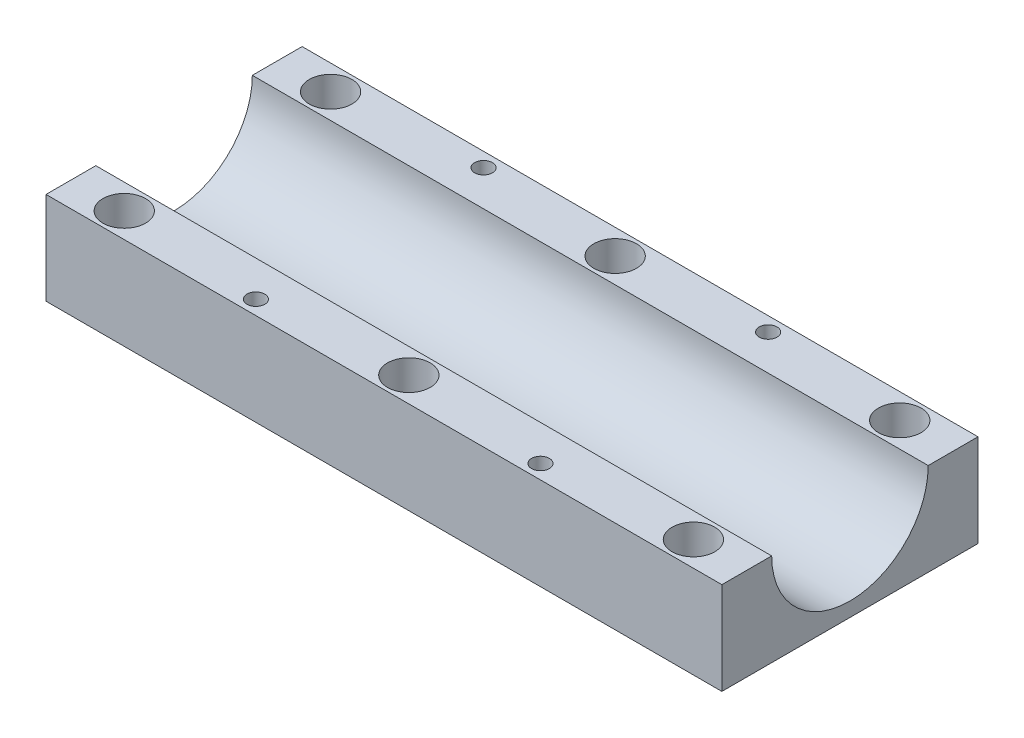
ISO-10303-21;
HEADER;
FILE_DESCRIPTION(('STEP AP214'),'2;1');
FILE_NAME('part.step','',(''),(''),'','','');
FILE_SCHEMA(('AUTOMOTIVE_DESIGN { 1 0 10303 214 1 1 1 1 }'));
ENDSEC;
DATA;
#1=APPLICATION_CONTEXT('core data for automotive mechanical design processes');
#2=APPLICATION_PROTOCOL_DEFINITION('international standard','automotive_design',2000,#1);
#3=PRODUCT_CONTEXT('',#1,'mechanical');
#4=PRODUCT('Part','Part','',(#3));
#5=PRODUCT_RELATED_PRODUCT_CATEGORY('part','',(#4));
#6=PRODUCT_DEFINITION_FORMATION('','',#4);
#7=PRODUCT_DEFINITION_CONTEXT('part definition',#1,'design');
#8=PRODUCT_DEFINITION('design','',#6,#7);
#9=PRODUCT_DEFINITION_SHAPE('','',#8);
#10=(LENGTH_UNIT() NAMED_UNIT(*) SI_UNIT(.MILLI.,.METRE.));
#11=(NAMED_UNIT(*) PLANE_ANGLE_UNIT() SI_UNIT($,.RADIAN.));
#12=(NAMED_UNIT(*) SI_UNIT($,.STERADIAN.) SOLID_ANGLE_UNIT());
#13=UNCERTAINTY_MEASURE_WITH_UNIT(LENGTH_MEASURE(1.E-05),#10,'distance_accuracy_value','');
#14=(GEOMETRIC_REPRESENTATION_CONTEXT(3) GLOBAL_UNCERTAINTY_ASSIGNED_CONTEXT((#13)) GLOBAL_UNIT_ASSIGNED_CONTEXT((#10,
#11,#12)) REPRESENTATION_CONTEXT('',''));
#15=CARTESIAN_POINT('',(0.,0.,0.));
#16=DIRECTION('',(0.,0.,1.));
#17=DIRECTION('',(1.,0.,0.));
#18=AXIS2_PLACEMENT_3D('',#15,#16,#17);
#19=CARTESIAN_POINT('',(7.5,13.,-32.5));
#20=DIRECTION('',(0.,-1.,0.));
#21=DIRECTION('',(0.,0.,-1.));
#22=AXIS2_PLACEMENT_3D('',#19,#20,#21);
#23=CYLINDRICAL_SURFACE('',#22,1.75);
#24=CARTESIAN_POINT('',(7.5,0.,-32.5));
#25=DIRECTION('',(0.,1.,0.));
#26=DIRECTION('',(0.,0.,1.));
#27=AXIS2_PLACEMENT_3D('',#24,#25,#26);
#28=CIRCLE('',#27,1.75);
#29=CARTESIAN_POINT('',(7.5,0.,-30.75));
#30=VERTEX_POINT('',#29);
#31=EDGE_CURVE('E114',#30,#30,#28,.T.);
#32=ORIENTED_EDGE('',*,*,#31,.F.);
#33=EDGE_LOOP('',(#32));
#34=FACE_BOUND('',#33,.T.);
#35=CARTESIAN_POINT('',(7.5,8.,-32.5));
#36=DIRECTION('',(0.,1.,0.));
#37=DIRECTION('',(0.,0.,1.));
#38=AXIS2_PLACEMENT_3D('',#35,#36,#37);
#39=CIRCLE('',#38,1.75);
#40=CARTESIAN_POINT('',(7.5,8.,-30.75));
#41=VERTEX_POINT('',#40);
#42=EDGE_CURVE('E38',#41,#41,#39,.T.);
#43=ORIENTED_EDGE('',*,*,#42,.T.);
#44=EDGE_LOOP('',(#43));
#45=FACE_BOUND('',#44,.T.);
#46=ADVANCED_FACE('F34',(#34,#45),#23,.F.);
#47=CARTESIAN_POINT('',(47.5,13.,-32.5));
#48=DIRECTION('',(0.,-1.,0.));
#49=DIRECTION('',(0.,0.,-1.));
#50=AXIS2_PLACEMENT_3D('',#47,#48,#49);
#51=CYLINDRICAL_SURFACE('',#50,1.75);
#52=CARTESIAN_POINT('',(47.5,0.,-32.5));
#53=DIRECTION('',(0.,1.,0.));
#54=DIRECTION('',(0.,0.,1.));
#55=AXIS2_PLACEMENT_3D('',#52,#53,#54);
#56=CIRCLE('',#55,1.75);
#57=CARTESIAN_POINT('',(47.5,0.,-30.75));
#58=VERTEX_POINT('',#57);
#59=EDGE_CURVE('E187',#58,#58,#56,.T.);
#60=ORIENTED_EDGE('',*,*,#59,.F.);
#61=EDGE_LOOP('',(#60));
#62=FACE_BOUND('',#61,.T.);
#63=CARTESIAN_POINT('',(47.5,8.,-32.5));
#64=DIRECTION('',(0.,1.,0.));
#65=DIRECTION('',(0.,0.,1.));
#66=AXIS2_PLACEMENT_3D('',#63,#64,#65);
#67=CIRCLE('',#66,1.75);
#68=CARTESIAN_POINT('',(47.5,8.,-30.75));
#69=VERTEX_POINT('',#68);
#70=EDGE_CURVE('E150',#69,#69,#67,.T.);
#71=ORIENTED_EDGE('',*,*,#70,.T.);
#72=EDGE_LOOP('',(#71));
#73=FACE_BOUND('',#72,.T.);
#74=ADVANCED_FACE('F198',(#62,#73),#51,.F.);
#75=CARTESIAN_POINT('',(87.5,13.,-32.5));
#76=DIRECTION('',(0.,-1.,0.));
#77=DIRECTION('',(0.,0.,-1.));
#78=AXIS2_PLACEMENT_3D('',#75,#76,#77);
#79=CYLINDRICAL_SURFACE('',#78,1.75000000000001);
#80=CARTESIAN_POINT('',(87.5,0.,-32.5));
#81=DIRECTION('',(0.,1.,0.));
#82=DIRECTION('',(0.,0.,1.));
#83=AXIS2_PLACEMENT_3D('',#80,#81,#82);
#84=CIRCLE('',#83,1.75000000000001);
#85=CARTESIAN_POINT('',(87.5,0.,-30.75));
#86=VERTEX_POINT('',#85);
#87=EDGE_CURVE('E185',#86,#86,#84,.T.);
#88=ORIENTED_EDGE('',*,*,#87,.F.);
#89=EDGE_LOOP('',(#88));
#90=FACE_BOUND('',#89,.T.);
#91=CARTESIAN_POINT('',(87.5,8.,-32.5));
#92=DIRECTION('',(0.,1.,0.));
#93=DIRECTION('',(0.,0.,1.));
#94=AXIS2_PLACEMENT_3D('',#91,#92,#93);
#95=CIRCLE('',#94,1.75000000000001);
#96=CARTESIAN_POINT('',(87.5,8.,-30.75));
#97=VERTEX_POINT('',#96);
#98=EDGE_CURVE('E148',#97,#97,#95,.T.);
#99=ORIENTED_EDGE('',*,*,#98,.T.);
#100=EDGE_LOOP('',(#99));
#101=FACE_BOUND('',#100,.T.);
#102=ADVANCED_FACE('F203',(#90,#101),#79,.F.);
#103=CARTESIAN_POINT('',(0.,13.,0.));
#104=DIRECTION('',(0.,-1.,0.));
#105=DIRECTION('',(0.,0.,-1.));
#106=AXIS2_PLACEMENT_3D('',#103,#104,#105);
#107=PLANE('',#106);
#108=CARTESIAN_POINT('',(27.5,13.,-34.));
#109=DIRECTION('',(0.,1.,0.));
#110=DIRECTION('',(0.,0.,1.));
#111=AXIS2_PLACEMENT_3D('',#108,#109,#110);
#112=CIRCLE('',#111,1.25);
#113=CARTESIAN_POINT('',(27.5,13.,-32.75));
#114=VERTEX_POINT('',#113);
#115=EDGE_CURVE('E328',#114,#114,#112,.T.);
#116=ORIENTED_EDGE('',*,*,#115,.F.);
#117=EDGE_LOOP('',(#116));
#118=FACE_BOUND('',#117,.T.);
#119=CARTESIAN_POINT('',(47.5,13.,-32.5));
#120=DIRECTION('',(0.,1.,0.));
#121=DIRECTION('',(0.,0.,1.));
#122=AXIS2_PLACEMENT_3D('',#119,#120,#121);
#123=CIRCLE('',#122,3.);
#124=CARTESIAN_POINT('',(47.5,13.,-29.5));
#125=VERTEX_POINT('',#124);
#126=EDGE_CURVE('E276',#125,#125,#123,.T.);
#127=ORIENTED_EDGE('',*,*,#126,.F.);
#128=EDGE_LOOP('',(#127));
#129=FACE_BOUND('',#128,.T.);
#130=CARTESIAN_POINT('',(87.5,13.,-32.5));
#131=DIRECTION('',(0.,1.,0.));
#132=DIRECTION('',(0.,0.,1.));
#133=AXIS2_PLACEMENT_3D('',#130,#131,#132);
#134=CIRCLE('',#133,3.00000000000001);
#135=CARTESIAN_POINT('',(87.5,13.,-29.5));
#136=VERTEX_POINT('',#135);
#137=EDGE_CURVE('E277',#136,#136,#134,.T.);
#138=ORIENTED_EDGE('',*,*,#137,.F.);
#139=EDGE_LOOP('',(#138));
#140=FACE_BOUND('',#139,.T.);
#141=CARTESIAN_POINT('',(67.5,13.,-34.));
#142=DIRECTION('',(0.,1.,0.));
#143=DIRECTION('',(0.,0.,1.));
#144=AXIS2_PLACEMENT_3D('',#141,#142,#143);
#145=CIRCLE('',#144,1.25);
#146=CARTESIAN_POINT('',(67.5,13.,-32.75));
#147=VERTEX_POINT('',#146);
#148=EDGE_CURVE('E320',#147,#147,#145,.T.);
#149=ORIENTED_EDGE('',*,*,#148,.F.);
#150=EDGE_LOOP('',(#149));
#151=FACE_BOUND('',#150,.T.);
#152=CARTESIAN_POINT('',(7.5,13.,-32.5));
#153=DIRECTION('',(0.,1.,0.));
#154=DIRECTION('',(0.,0.,1.));
#155=AXIS2_PLACEMENT_3D('',#152,#153,#154);
#156=CIRCLE('',#155,3.);
#157=CARTESIAN_POINT('',(7.5,13.,-29.5));
#158=VERTEX_POINT('',#157);
#159=EDGE_CURVE('E167',#158,#158,#156,.T.);
#160=ORIENTED_EDGE('',*,*,#159,.F.);
#161=EDGE_LOOP('',(#160));
#162=FACE_BOUND('',#161,.T.);
#163=DIRECTION('',(0.,0.,1.));
#164=VECTOR('',#163,1.);
#165=CARTESIAN_POINT('',(0.,13.,0.));
#166=LINE('',#165,#164);
#167=CARTESIAN_POINT('',(0.,13.,-36.));
#168=VERTEX_POINT('',#167);
#169=CARTESIAN_POINT('',(0.,13.,-29.));
#170=VERTEX_POINT('',#169);
#171=EDGE_CURVE('E105',#168,#170,#166,.T.);
#172=ORIENTED_EDGE('',*,*,#171,.T.);
#173=DIRECTION('',(1.,0.,0.));
#174=VECTOR('',#173,1.);
#175=CARTESIAN_POINT('',(0.,13.,-29.));
#176=LINE('',#175,#174);
#177=CARTESIAN_POINT('',(95.,13.,-29.));
#178=VERTEX_POINT('',#177);
#179=EDGE_CURVE('E96',#170,#178,#176,.T.);
#180=ORIENTED_EDGE('',*,*,#179,.T.);
#181=DIRECTION('',(0.,0.,-1.));
#182=VECTOR('',#181,1.);
#183=CARTESIAN_POINT('',(95.,13.,0.));
#184=LINE('',#183,#182);
#185=CARTESIAN_POINT('',(95.,13.,-36.));
#186=VERTEX_POINT('',#185);
#187=EDGE_CURVE('E111',#178,#186,#184,.T.);
#188=ORIENTED_EDGE('',*,*,#187,.T.);
#189=DIRECTION('',(-1.,0.,0.));
#190=VECTOR('',#189,1.);
#191=CARTESIAN_POINT('',(0.,13.,-36.));
#192=LINE('',#191,#190);
#193=EDGE_CURVE('E59',#186,#168,#192,.T.);
#194=ORIENTED_EDGE('',*,*,#193,.T.);
#195=EDGE_LOOP('',(#172,#180,#188,#194));
#196=FACE_BOUND('',#195,.T.);
#197=ADVANCED_FACE('F108',(#118,#129,#140,#151,#162,#196),#107,.F.);
#198=CARTESIAN_POINT('',(7.5,13.,-3.5));
#199=DIRECTION('',(0.,1.,0.));
#200=DIRECTION('',(0.,0.,-1.));
#201=AXIS2_PLACEMENT_3D('',#198,#199,#200);
#202=CIRCLE('',#201,3.);
#203=CARTESIAN_POINT('',(7.5,13.,-6.5));
#204=VERTEX_POINT('',#203);
#205=EDGE_CURVE('E173',#204,#204,#202,.T.);
#206=ORIENTED_EDGE('',*,*,#205,.F.);
#207=EDGE_LOOP('',(#206));
#208=FACE_BOUND('',#207,.T.);
#209=CARTESIAN_POINT('',(67.5,13.,-1.99999999999999));
#210=DIRECTION('',(0.,1.,0.));
#211=DIRECTION('',(0.,0.,-1.));
#212=AXIS2_PLACEMENT_3D('',#209,#210,#211);
#213=CIRCLE('',#212,1.25);
#214=CARTESIAN_POINT('',(67.5,13.,-3.24999999999999));
#215=VERTEX_POINT('',#214);
#216=EDGE_CURVE('E289',#215,#215,#213,.T.);
#217=ORIENTED_EDGE('',*,*,#216,.F.);
#218=EDGE_LOOP('',(#217));
#219=FACE_BOUND('',#218,.T.);
#220=CARTESIAN_POINT('',(47.5,13.,-3.5));
#221=DIRECTION('',(0.,1.,0.));
#222=DIRECTION('',(0.,0.,-1.));
#223=AXIS2_PLACEMENT_3D('',#220,#221,#222);
#224=CIRCLE('',#223,3.);
#225=CARTESIAN_POINT('',(47.5,13.,-6.5));
#226=VERTEX_POINT('',#225);
#227=EDGE_CURVE('E294',#226,#226,#224,.T.);
#228=ORIENTED_EDGE('',*,*,#227,.F.);
#229=EDGE_LOOP('',(#228));
#230=FACE_BOUND('',#229,.T.);
#231=CARTESIAN_POINT('',(87.5,13.,-3.5));
#232=DIRECTION('',(0.,1.,0.));
#233=DIRECTION('',(0.,0.,-1.));
#234=AXIS2_PLACEMENT_3D('',#231,#232,#233);
#235=CIRCLE('',#234,3.00000000000001);
#236=CARTESIAN_POINT('',(87.5,13.,-6.5));
#237=VERTEX_POINT('',#236);
#238=EDGE_CURVE('E311',#237,#237,#235,.T.);
#239=ORIENTED_EDGE('',*,*,#238,.F.);
#240=EDGE_LOOP('',(#239));
#241=FACE_BOUND('',#240,.T.);
#242=CARTESIAN_POINT('',(27.5,13.,-1.99999999999999));
#243=DIRECTION('',(0.,1.,0.));
#244=DIRECTION('',(0.,0.,-1.));
#245=AXIS2_PLACEMENT_3D('',#242,#243,#244);
#246=CIRCLE('',#245,1.25);
#247=CARTESIAN_POINT('',(27.5,13.,-3.25));
#248=VERTEX_POINT('',#247);
#249=EDGE_CURVE('E314',#248,#248,#246,.T.);
#250=ORIENTED_EDGE('',*,*,#249,.F.);
#251=EDGE_LOOP('',(#250));
#252=FACE_BOUND('',#251,.T.);
#253=CARTESIAN_POINT('',(95.,13.,0.));
#254=VERTEX_POINT('',#253);
#255=CARTESIAN_POINT('',(95.,13.,-7.));
#256=VERTEX_POINT('',#255);
#257=EDGE_CURVE('E117',#254,#256,#184,.T.);
#258=ORIENTED_EDGE('',*,*,#257,.T.);
#259=DIRECTION('',(1.,0.,0.));
#260=VECTOR('',#259,1.);
#261=CARTESIAN_POINT('',(0.,13.,-7.));
#262=LINE('',#261,#260);
#263=CARTESIAN_POINT('',(0.,13.,-7.));
#264=VERTEX_POINT('',#263);
#265=EDGE_CURVE('E51',#256,#264,#262,.F.);
#266=ORIENTED_EDGE('',*,*,#265,.T.);
#267=CARTESIAN_POINT('',(0.,13.,0.));
#268=VERTEX_POINT('',#267);
#269=EDGE_CURVE('E87',#264,#268,#166,.T.);
#270=ORIENTED_EDGE('',*,*,#269,.T.);
#271=DIRECTION('',(1.,0.,0.));
#272=VECTOR('',#271,1.);
#273=CARTESIAN_POINT('',(0.,13.,0.));
#274=LINE('',#273,#272);
#275=EDGE_CURVE('E109',#268,#254,#274,.T.);
#276=ORIENTED_EDGE('',*,*,#275,.T.);
#277=EDGE_LOOP('',(#258,#266,#270,#276));
#278=FACE_BOUND('',#277,.T.);
#279=ADVANCED_FACE('F208',(#208,#219,#230,#241,#252,#278),#107,.F.);
#280=CARTESIAN_POINT('',(0.,0.,0.));
#281=DIRECTION('',(0.,-1.,0.));
#282=DIRECTION('',(0.,0.,-1.));
#283=AXIS2_PLACEMENT_3D('',#280,#281,#282);
#284=PLANE('',#283);
#285=CARTESIAN_POINT('',(47.5,0.,-3.5));
#286=DIRECTION('',(0.,1.,0.));
#287=DIRECTION('',(0.,0.,-1.));
#288=AXIS2_PLACEMENT_3D('',#285,#286,#287);
#289=CIRCLE('',#288,1.75);
#290=CARTESIAN_POINT('',(47.5,0.,-5.24999999999999));
#291=VERTEX_POINT('',#290);
#292=EDGE_CURVE('E179',#291,#291,#289,.T.);
#293=ORIENTED_EDGE('',*,*,#292,.T.);
#294=EDGE_LOOP('',(#293));
#295=FACE_BOUND('',#294,.T.);
#296=ORIENTED_EDGE('',*,*,#87,.T.);
#297=EDGE_LOOP('',(#296));
#298=FACE_BOUND('',#297,.T.);
#299=ORIENTED_EDGE('',*,*,#31,.T.);
#300=EDGE_LOOP('',(#299));
#301=FACE_BOUND('',#300,.T.);
#302=DIRECTION('',(0.,0.,1.));
#303=VECTOR('',#302,1.);
#304=CARTESIAN_POINT('',(0.,0.,0.));
#305=LINE('',#304,#303);
#306=CARTESIAN_POINT('',(0.,0.,-36.));
#307=VERTEX_POINT('',#306);
#308=CARTESIAN_POINT('',(0.,0.,0.));
#309=VERTEX_POINT('',#308);
#310=EDGE_CURVE('E122',#307,#309,#305,.T.);
#311=ORIENTED_EDGE('',*,*,#310,.F.);
#312=DIRECTION('',(-1.,0.,0.));
#313=VECTOR('',#312,1.);
#314=CARTESIAN_POINT('',(0.,0.,-36.));
#315=LINE('',#314,#313);
#316=CARTESIAN_POINT('',(95.,0.,-36.));
#317=VERTEX_POINT('',#316);
#318=EDGE_CURVE('E80',#317,#307,#315,.T.);
#319=ORIENTED_EDGE('',*,*,#318,.F.);
#320=DIRECTION('',(0.,0.,-1.));
#321=VECTOR('',#320,1.);
#322=CARTESIAN_POINT('',(95.,0.,0.));
#323=LINE('',#322,#321);
#324=CARTESIAN_POINT('',(95.,0.,0.));
#325=VERTEX_POINT('',#324);
#326=EDGE_CURVE('E127',#325,#317,#323,.T.);
#327=ORIENTED_EDGE('',*,*,#326,.F.);
#328=DIRECTION('',(1.,0.,0.));
#329=VECTOR('',#328,1.);
#330=CARTESIAN_POINT('',(0.,0.,0.));
#331=LINE('',#330,#329);
#332=EDGE_CURVE('E125',#309,#325,#331,.T.);
#333=ORIENTED_EDGE('',*,*,#332,.F.);
#334=EDGE_LOOP('',(#311,#319,#327,#333));
#335=FACE_BOUND('',#334,.T.);
#336=ORIENTED_EDGE('',*,*,#59,.T.);
#337=EDGE_LOOP('',(#336));
#338=FACE_BOUND('',#337,.T.);
#339=CARTESIAN_POINT('',(87.5,0.,-3.5));
#340=DIRECTION('',(0.,1.,0.));
#341=DIRECTION('',(0.,0.,-1.));
#342=AXIS2_PLACEMENT_3D('',#339,#340,#341);
#343=CIRCLE('',#342,1.75000000000001);
#344=CARTESIAN_POINT('',(87.5,0.,-5.25000000000001));
#345=VERTEX_POINT('',#344);
#346=EDGE_CURVE('E182',#345,#345,#343,.T.);
#347=ORIENTED_EDGE('',*,*,#346,.T.);
#348=EDGE_LOOP('',(#347));
#349=FACE_BOUND('',#348,.T.);
#350=CARTESIAN_POINT('',(7.5,0.,-3.5));
#351=DIRECTION('',(0.,1.,0.));
#352=DIRECTION('',(0.,0.,-1.));
#353=AXIS2_PLACEMENT_3D('',#350,#351,#352);
#354=CIRCLE('',#353,1.75);
#355=CARTESIAN_POINT('',(7.5,0.,-5.25));
#356=VERTEX_POINT('',#355);
#357=EDGE_CURVE('E101',#356,#356,#354,.T.);
#358=ORIENTED_EDGE('',*,*,#357,.T.);
#359=EDGE_LOOP('',(#358));
#360=FACE_BOUND('',#359,.T.);
#361=ADVANCED_FACE('F194',(#295,#298,#301,#335,#338,#349,#360),#284,.T.);
#362=CARTESIAN_POINT('',(0.,13.,0.));
#363=DIRECTION('',(1.,0.,0.));
#364=DIRECTION('',(0.,0.,-1.));
#365=AXIS2_PLACEMENT_3D('',#362,#363,#364);
#366=PLANE('',#365);
#367=ORIENTED_EDGE('',*,*,#269,.F.);
#368=CARTESIAN_POINT('',(0.,13.,-18.));
#369=DIRECTION('',(1.,0.,0.));
#370=DIRECTION('',(0.,0.,-1.));
#371=AXIS2_PLACEMENT_3D('',#368,#369,#370);
#372=CIRCLE('',#371,11.);
#373=EDGE_CURVE('E99',#264,#170,#372,.T.);
#374=ORIENTED_EDGE('',*,*,#373,.T.);
#375=ORIENTED_EDGE('',*,*,#171,.F.);
#376=DIRECTION('',(0.,-1.,0.));
#377=VECTOR('',#376,1.);
#378=CARTESIAN_POINT('',(0.,13.,-36.));
#379=LINE('',#378,#377);
#380=EDGE_CURVE('E121',#168,#307,#379,.T.);
#381=ORIENTED_EDGE('',*,*,#380,.T.);
#382=ORIENTED_EDGE('',*,*,#310,.T.);
#383=DIRECTION('',(0.,-1.,0.));
#384=VECTOR('',#383,1.);
#385=CARTESIAN_POINT('',(0.,13.,0.));
#386=LINE('',#385,#384);
#387=EDGE_CURVE('E43',#268,#309,#386,.T.);
#388=ORIENTED_EDGE('',*,*,#387,.F.);
#389=EDGE_LOOP('',(#367,#374,#375,#381,#382,#388));
#390=FACE_BOUND('',#389,.T.);
#391=ADVANCED_FACE('F36',(#390),#366,.F.);
#392=CARTESIAN_POINT('',(0.,13.,0.));
#393=DIRECTION('',(0.,0.,-1.));
#394=DIRECTION('',(-1.,0.,0.));
#395=AXIS2_PLACEMENT_3D('',#392,#393,#394);
#396=PLANE('',#395);
#397=ORIENTED_EDGE('',*,*,#332,.T.);
#398=DIRECTION('',(0.,-1.,0.));
#399=VECTOR('',#398,1.);
#400=CARTESIAN_POINT('',(95.,13.,0.));
#401=LINE('',#400,#399);
#402=EDGE_CURVE('E133',#254,#325,#401,.T.);
#403=ORIENTED_EDGE('',*,*,#402,.F.);
#404=ORIENTED_EDGE('',*,*,#275,.F.);
#405=ORIENTED_EDGE('',*,*,#387,.T.);
#406=EDGE_LOOP('',(#397,#403,#404,#405));
#407=FACE_BOUND('',#406,.T.);
#408=ADVANCED_FACE('F221',(#407),#396,.F.);
#409=CARTESIAN_POINT('',(95.,13.,0.));
#410=DIRECTION('',(-1.,0.,0.));
#411=DIRECTION('',(0.,0.,1.));
#412=AXIS2_PLACEMENT_3D('',#409,#410,#411);
#413=PLANE('',#412);
#414=ORIENTED_EDGE('',*,*,#187,.F.);
#415=CARTESIAN_POINT('',(95.,13.,-18.));
#416=DIRECTION('',(-1.,0.,0.));
#417=DIRECTION('',(0.,0.,1.));
#418=AXIS2_PLACEMENT_3D('',#415,#416,#417);
#419=CIRCLE('',#418,11.);
#420=EDGE_CURVE('E11',#178,#256,#419,.T.);
#421=ORIENTED_EDGE('',*,*,#420,.T.);
#422=ORIENTED_EDGE('',*,*,#257,.F.);
#423=ORIENTED_EDGE('',*,*,#402,.T.);
#424=ORIENTED_EDGE('',*,*,#326,.T.);
#425=DIRECTION('',(0.,-1.,0.));
#426=VECTOR('',#425,1.);
#427=CARTESIAN_POINT('',(95.,13.,-36.));
#428=LINE('',#427,#426);
#429=EDGE_CURVE('E131',#186,#317,#428,.T.);
#430=ORIENTED_EDGE('',*,*,#429,.F.);
#431=EDGE_LOOP('',(#414,#421,#422,#423,#424,#430));
#432=FACE_BOUND('',#431,.T.);
#433=ADVANCED_FACE('F219',(#432),#413,.F.);
#434=CARTESIAN_POINT('',(0.,13.,-36.));
#435=DIRECTION('',(0.,0.,1.));
#436=DIRECTION('',(1.,0.,0.));
#437=AXIS2_PLACEMENT_3D('',#434,#435,#436);
#438=PLANE('',#437);
#439=ORIENTED_EDGE('',*,*,#318,.T.);
#440=ORIENTED_EDGE('',*,*,#380,.F.);
#441=ORIENTED_EDGE('',*,*,#193,.F.);
#442=ORIENTED_EDGE('',*,*,#429,.T.);
#443=EDGE_LOOP('',(#439,#440,#441,#442));
#444=FACE_BOUND('',#443,.T.);
#445=ADVANCED_FACE('F215',(#444),#438,.F.);
#446=CARTESIAN_POINT('',(87.5,13.,-3.5));
#447=DIRECTION('',(0.,-1.,0.));
#448=DIRECTION('',(0.,0.,-1.));
#449=AXIS2_PLACEMENT_3D('',#446,#447,#448);
#450=CYLINDRICAL_SURFACE('',#449,1.75000000000001);
#451=CARTESIAN_POINT('',(87.5,8.,-3.5));
#452=DIRECTION('',(0.,-1.,0.));
#453=DIRECTION('',(0.,0.,-1.));
#454=AXIS2_PLACEMENT_3D('',#451,#452,#453);
#455=CIRCLE('',#454,1.75000000000001);
#456=CARTESIAN_POINT('',(87.5,8.,-5.25000000000001));
#457=VERTEX_POINT('',#456);
#458=EDGE_CURVE('E145',#457,#457,#455,.T.);
#459=ORIENTED_EDGE('',*,*,#458,.F.);
#460=EDGE_LOOP('',(#459));
#461=FACE_BOUND('',#460,.T.);
#462=ORIENTED_EDGE('',*,*,#346,.F.);
#463=EDGE_LOOP('',(#462));
#464=FACE_BOUND('',#463,.T.);
#465=ADVANCED_FACE('F218',(#461,#464),#450,.F.);
#466=CARTESIAN_POINT('',(47.5,13.,-3.5));
#467=DIRECTION('',(0.,-1.,0.));
#468=DIRECTION('',(0.,0.,-1.));
#469=AXIS2_PLACEMENT_3D('',#466,#467,#468);
#470=CYLINDRICAL_SURFACE('',#469,1.75);
#471=CARTESIAN_POINT('',(47.5,8.,-3.5));
#472=DIRECTION('',(0.,-1.,0.));
#473=DIRECTION('',(0.,0.,-1.));
#474=AXIS2_PLACEMENT_3D('',#471,#472,#473);
#475=CIRCLE('',#474,1.75);
#476=CARTESIAN_POINT('',(47.5,8.,-5.24999999999999));
#477=VERTEX_POINT('',#476);
#478=EDGE_CURVE('E141',#477,#477,#475,.T.);
#479=ORIENTED_EDGE('',*,*,#478,.F.);
#480=EDGE_LOOP('',(#479));
#481=FACE_BOUND('',#480,.T.);
#482=ORIENTED_EDGE('',*,*,#292,.F.);
#483=EDGE_LOOP('',(#482));
#484=FACE_BOUND('',#483,.T.);
#485=ADVANCED_FACE('F240',(#481,#484),#470,.F.);
#486=CARTESIAN_POINT('',(7.5,13.,-3.5));
#487=DIRECTION('',(0.,-1.,0.));
#488=DIRECTION('',(0.,0.,-1.));
#489=AXIS2_PLACEMENT_3D('',#486,#487,#488);
#490=CYLINDRICAL_SURFACE('',#489,1.75);
#491=CARTESIAN_POINT('',(7.5,8.,-3.5));
#492=DIRECTION('',(0.,-1.,0.));
#493=DIRECTION('',(0.,0.,-1.));
#494=AXIS2_PLACEMENT_3D('',#491,#492,#493);
#495=CIRCLE('',#494,1.75);
#496=CARTESIAN_POINT('',(7.5,8.,-5.25));
#497=VERTEX_POINT('',#496);
#498=EDGE_CURVE('E138',#497,#497,#495,.T.);
#499=ORIENTED_EDGE('',*,*,#498,.F.);
#500=EDGE_LOOP('',(#499));
#501=FACE_BOUND('',#500,.T.);
#502=ORIENTED_EDGE('',*,*,#357,.F.);
#503=EDGE_LOOP('',(#502));
#504=FACE_BOUND('',#503,.T.);
#505=ADVANCED_FACE('F238',(#501,#504),#490,.F.);
#506=CARTESIAN_POINT('',(0.,13.,-18.));
#507=DIRECTION('',(1.,0.,0.));
#508=DIRECTION('',(0.,0.,-1.));
#509=AXIS2_PLACEMENT_3D('',#506,#507,#508);
#510=CYLINDRICAL_SURFACE('',#509,11.);
#511=ORIENTED_EDGE('',*,*,#373,.F.);
#512=ORIENTED_EDGE('',*,*,#265,.F.);
#513=ORIENTED_EDGE('',*,*,#420,.F.);
#514=ORIENTED_EDGE('',*,*,#179,.F.);
#515=EDGE_LOOP('',(#511,#512,#513,#514));
#516=FACE_BOUND('',#515,.T.);
#517=ADVANCED_FACE('F98',(#516),#510,.F.);
#518=CARTESIAN_POINT('',(7.5,8.,-3.5));
#519=DIRECTION('',(0.,1.,0.));
#520=DIRECTION('',(0.,0.,1.));
#521=AXIS2_PLACEMENT_3D('',#518,#519,#520);
#522=CYLINDRICAL_SURFACE('',#521,3.);
#523=CARTESIAN_POINT('',(7.5,8.,-3.5));
#524=DIRECTION('',(0.,1.,0.));
#525=DIRECTION('',(0.,0.,-1.));
#526=AXIS2_PLACEMENT_3D('',#523,#524,#525);
#527=CIRCLE('',#526,3.);
#528=CARTESIAN_POINT('',(7.5,8.,-6.5));
#529=VERTEX_POINT('',#528);
#530=EDGE_CURVE('E292',#529,#529,#527,.T.);
#531=ORIENTED_EDGE('',*,*,#530,.F.);
#532=EDGE_LOOP('',(#531));
#533=FACE_BOUND('',#532,.T.);
#534=ORIENTED_EDGE('',*,*,#205,.T.);
#535=EDGE_LOOP('',(#534));
#536=FACE_BOUND('',#535,.T.);
#537=ADVANCED_FACE('F247',(#533,#536),#522,.F.);
#538=CARTESIAN_POINT('',(7.5,8.,-3.5));
#539=DIRECTION('',(0.,-1.,0.));
#540=DIRECTION('',(0.,0.,-1.));
#541=AXIS2_PLACEMENT_3D('',#538,#539,#540);
#542=PLANE('',#541);
#543=ORIENTED_EDGE('',*,*,#498,.T.);
#544=EDGE_LOOP('',(#543));
#545=FACE_BOUND('',#544,.T.);
#546=ORIENTED_EDGE('',*,*,#530,.T.);
#547=EDGE_LOOP('',(#546));
#548=FACE_BOUND('',#547,.T.);
#549=ADVANCED_FACE('F357',(#545,#548),#542,.F.);
#550=CARTESIAN_POINT('',(47.5,8.,-3.5));
#551=DIRECTION('',(0.,1.,0.));
#552=DIRECTION('',(0.,0.,1.));
#553=AXIS2_PLACEMENT_3D('',#550,#551,#552);
#554=CYLINDRICAL_SURFACE('',#553,3.);
#555=CARTESIAN_POINT('',(47.5,8.,-3.5));
#556=DIRECTION('',(0.,1.,0.));
#557=DIRECTION('',(0.,0.,-1.));
#558=AXIS2_PLACEMENT_3D('',#555,#556,#557);
#559=CIRCLE('',#558,3.);
#560=CARTESIAN_POINT('',(47.5,8.,-6.5));
#561=VERTEX_POINT('',#560);
#562=EDGE_CURVE('E298',#561,#561,#559,.T.);
#563=ORIENTED_EDGE('',*,*,#562,.F.);
#564=EDGE_LOOP('',(#563));
#565=FACE_BOUND('',#564,.T.);
#566=ORIENTED_EDGE('',*,*,#227,.T.);
#567=EDGE_LOOP('',(#566));
#568=FACE_BOUND('',#567,.T.);
#569=ADVANCED_FACE('F361',(#565,#568),#554,.F.);
#570=CARTESIAN_POINT('',(47.5,8.,-3.5));
#571=DIRECTION('',(0.,-1.,0.));
#572=DIRECTION('',(0.,0.,-1.));
#573=AXIS2_PLACEMENT_3D('',#570,#571,#572);
#574=PLANE('',#573);
#575=ORIENTED_EDGE('',*,*,#478,.T.);
#576=EDGE_LOOP('',(#575));
#577=FACE_BOUND('',#576,.T.);
#578=ORIENTED_EDGE('',*,*,#562,.T.);
#579=EDGE_LOOP('',(#578));
#580=FACE_BOUND('',#579,.T.);
#581=ADVANCED_FACE('F399',(#577,#580),#574,.F.);
#582=CARTESIAN_POINT('',(87.5,8.,-3.5));
#583=DIRECTION('',(0.,1.,0.));
#584=DIRECTION('',(0.,0.,1.));
#585=AXIS2_PLACEMENT_3D('',#582,#583,#584);
#586=CYLINDRICAL_SURFACE('',#585,3.00000000000001);
#587=CARTESIAN_POINT('',(87.5,8.,-3.5));
#588=DIRECTION('',(0.,1.,0.));
#589=DIRECTION('',(0.,0.,-1.));
#590=AXIS2_PLACEMENT_3D('',#587,#588,#589);
#591=CIRCLE('',#590,3.00000000000001);
#592=CARTESIAN_POINT('',(87.5,8.,-6.5));
#593=VERTEX_POINT('',#592);
#594=EDGE_CURVE('E317',#593,#593,#591,.T.);
#595=ORIENTED_EDGE('',*,*,#594,.F.);
#596=EDGE_LOOP('',(#595));
#597=FACE_BOUND('',#596,.T.);
#598=ORIENTED_EDGE('',*,*,#238,.T.);
#599=EDGE_LOOP('',(#598));
#600=FACE_BOUND('',#599,.T.);
#601=ADVANCED_FACE('F403',(#597,#600),#586,.F.);
#602=CARTESIAN_POINT('',(87.5,8.,-3.5));
#603=DIRECTION('',(0.,-1.,0.));
#604=DIRECTION('',(0.,0.,-1.));
#605=AXIS2_PLACEMENT_3D('',#602,#603,#604);
#606=PLANE('',#605);
#607=ORIENTED_EDGE('',*,*,#458,.T.);
#608=EDGE_LOOP('',(#607));
#609=FACE_BOUND('',#608,.T.);
#610=ORIENTED_EDGE('',*,*,#594,.T.);
#611=EDGE_LOOP('',(#610));
#612=FACE_BOUND('',#611,.T.);
#613=ADVANCED_FACE('F374',(#609,#612),#606,.F.);
#614=CARTESIAN_POINT('',(87.5,8.,-32.5));
#615=DIRECTION('',(0.,1.,0.));
#616=DIRECTION('',(0.,0.,1.));
#617=AXIS2_PLACEMENT_3D('',#614,#615,#616);
#618=CYLINDRICAL_SURFACE('',#617,3.00000000000001);
#619=CARTESIAN_POINT('',(87.5,8.,-32.5));
#620=DIRECTION('',(0.,1.,0.));
#621=DIRECTION('',(0.,0.,1.));
#622=AXIS2_PLACEMENT_3D('',#619,#620,#621);
#623=CIRCLE('',#622,3.00000000000001);
#624=CARTESIAN_POINT('',(87.5,8.,-29.5));
#625=VERTEX_POINT('',#624);
#626=EDGE_CURVE('E274',#625,#625,#623,.T.);
#627=ORIENTED_EDGE('',*,*,#626,.F.);
#628=EDGE_LOOP('',(#627));
#629=FACE_BOUND('',#628,.T.);
#630=ORIENTED_EDGE('',*,*,#137,.T.);
#631=EDGE_LOOP('',(#630));
#632=FACE_BOUND('',#631,.T.);
#633=ADVANCED_FACE('F270',(#629,#632),#618,.F.);
#634=CARTESIAN_POINT('',(87.5,8.,-32.5));
#635=DIRECTION('',(0.,1.,0.));
#636=DIRECTION('',(0.,0.,1.));
#637=AXIS2_PLACEMENT_3D('',#634,#635,#636);
#638=PLANE('',#637);
#639=ORIENTED_EDGE('',*,*,#98,.F.);
#640=EDGE_LOOP('',(#639));
#641=FACE_BOUND('',#640,.T.);
#642=ORIENTED_EDGE('',*,*,#626,.T.);
#643=EDGE_LOOP('',(#642));
#644=FACE_BOUND('',#643,.T.);
#645=ADVANCED_FACE('F266',(#641,#644),#638,.T.);
#646=CARTESIAN_POINT('',(47.5,8.,-32.5));
#647=DIRECTION('',(0.,1.,0.));
#648=DIRECTION('',(0.,0.,1.));
#649=AXIS2_PLACEMENT_3D('',#646,#647,#648);
#650=CYLINDRICAL_SURFACE('',#649,3.);
#651=CARTESIAN_POINT('',(47.5,8.,-32.5));
#652=DIRECTION('',(0.,1.,0.));
#653=DIRECTION('',(0.,0.,1.));
#654=AXIS2_PLACEMENT_3D('',#651,#652,#653);
#655=CIRCLE('',#654,3.);
#656=CARTESIAN_POINT('',(47.5,8.,-29.5));
#657=VERTEX_POINT('',#656);
#658=EDGE_CURVE('E280',#657,#657,#655,.T.);
#659=ORIENTED_EDGE('',*,*,#658,.F.);
#660=EDGE_LOOP('',(#659));
#661=FACE_BOUND('',#660,.T.);
#662=ORIENTED_EDGE('',*,*,#126,.T.);
#663=EDGE_LOOP('',(#662));
#664=FACE_BOUND('',#663,.T.);
#665=ADVANCED_FACE('F269',(#661,#664),#650,.F.);
#666=CARTESIAN_POINT('',(47.5,8.,-32.5));
#667=DIRECTION('',(0.,1.,0.));
#668=DIRECTION('',(0.,0.,1.));
#669=AXIS2_PLACEMENT_3D('',#666,#667,#668);
#670=PLANE('',#669);
#671=ORIENTED_EDGE('',*,*,#70,.F.);
#672=EDGE_LOOP('',(#671));
#673=FACE_BOUND('',#672,.T.);
#674=ORIENTED_EDGE('',*,*,#658,.T.);
#675=EDGE_LOOP('',(#674));
#676=FACE_BOUND('',#675,.T.);
#677=ADVANCED_FACE('F333',(#673,#676),#670,.T.);
#678=CARTESIAN_POINT('',(7.5,8.,-32.5));
#679=DIRECTION('',(0.,1.,0.));
#680=DIRECTION('',(0.,0.,1.));
#681=AXIS2_PLACEMENT_3D('',#678,#679,#680);
#682=CYLINDRICAL_SURFACE('',#681,3.);
#683=CARTESIAN_POINT('',(7.5,8.,-32.5));
#684=DIRECTION('',(0.,1.,0.));
#685=DIRECTION('',(0.,0.,1.));
#686=AXIS2_PLACEMENT_3D('',#683,#684,#685);
#687=CIRCLE('',#686,3.);
#688=CARTESIAN_POINT('',(7.5,8.,-29.5));
#689=VERTEX_POINT('',#688);
#690=EDGE_CURVE('E142',#689,#689,#687,.T.);
#691=ORIENTED_EDGE('',*,*,#690,.F.);
#692=EDGE_LOOP('',(#691));
#693=FACE_BOUND('',#692,.T.);
#694=ORIENTED_EDGE('',*,*,#159,.T.);
#695=EDGE_LOOP('',(#694));
#696=FACE_BOUND('',#695,.T.);
#697=ADVANCED_FACE('F162',(#693,#696),#682,.F.);
#698=CARTESIAN_POINT('',(7.5,8.,-32.5));
#699=DIRECTION('',(0.,1.,0.));
#700=DIRECTION('',(0.,0.,1.));
#701=AXIS2_PLACEMENT_3D('',#698,#699,#700);
#702=PLANE('',#701);
#703=ORIENTED_EDGE('',*,*,#42,.F.);
#704=EDGE_LOOP('',(#703));
#705=FACE_BOUND('',#704,.T.);
#706=ORIENTED_EDGE('',*,*,#690,.T.);
#707=EDGE_LOOP('',(#706));
#708=FACE_BOUND('',#707,.T.);
#709=ADVANCED_FACE('F158',(#705,#708),#702,.T.);
#710=CARTESIAN_POINT('',(27.5,8.,-1.99999999999999));
#711=DIRECTION('',(0.,1.,0.));
#712=DIRECTION('',(0.,0.,1.));
#713=AXIS2_PLACEMENT_3D('',#710,#711,#712);
#714=CYLINDRICAL_SURFACE('',#713,1.25);
#715=CARTESIAN_POINT('',(27.5,8.,-1.99999999999999));
#716=DIRECTION('',(0.,1.,0.));
#717=DIRECTION('',(0.,0.,-1.));
#718=AXIS2_PLACEMENT_3D('',#715,#716,#717);
#719=CIRCLE('',#718,1.25);
#720=CARTESIAN_POINT('',(27.5,8.,-3.25));
#721=VERTEX_POINT('',#720);
#722=EDGE_CURVE('E316',#721,#721,#719,.T.);
#723=ORIENTED_EDGE('',*,*,#722,.F.);
#724=EDGE_LOOP('',(#723));
#725=FACE_BOUND('',#724,.T.);
#726=ORIENTED_EDGE('',*,*,#249,.T.);
#727=EDGE_LOOP('',(#726));
#728=FACE_BOUND('',#727,.T.);
#729=ADVANCED_FACE('F161',(#725,#728),#714,.F.);
#730=CARTESIAN_POINT('',(27.5,8.,-1.99999999999999));
#731=DIRECTION('',(0.,-1.,0.));
#732=DIRECTION('',(0.,0.,-1.));
#733=AXIS2_PLACEMENT_3D('',#730,#731,#732);
#734=PLANE('',#733);
#735=ORIENTED_EDGE('',*,*,#722,.T.);
#736=EDGE_LOOP('',(#735));
#737=FACE_BOUND('',#736,.T.);
#738=ADVANCED_FACE('F367',(#737),#734,.F.);
#739=CARTESIAN_POINT('',(67.5,8.,-1.99999999999999));
#740=DIRECTION('',(0.,1.,0.));
#741=DIRECTION('',(0.,0.,1.));
#742=AXIS2_PLACEMENT_3D('',#739,#740,#741);
#743=CYLINDRICAL_SURFACE('',#742,1.25);
#744=CARTESIAN_POINT('',(67.5,8.,-1.99999999999999));
#745=DIRECTION('',(0.,1.,0.));
#746=DIRECTION('',(0.,0.,-1.));
#747=AXIS2_PLACEMENT_3D('',#744,#745,#746);
#748=CIRCLE('',#747,1.25);
#749=CARTESIAN_POINT('',(67.5,8.,-3.24999999999999));
#750=VERTEX_POINT('',#749);
#751=EDGE_CURVE('E283',#750,#750,#748,.T.);
#752=ORIENTED_EDGE('',*,*,#751,.F.);
#753=EDGE_LOOP('',(#752));
#754=FACE_BOUND('',#753,.T.);
#755=ORIENTED_EDGE('',*,*,#216,.T.);
#756=EDGE_LOOP('',(#755));
#757=FACE_BOUND('',#756,.T.);
#758=ADVANCED_FACE('F363',(#754,#757),#743,.F.);
#759=CARTESIAN_POINT('',(67.5,8.,-1.99999999999999));
#760=DIRECTION('',(0.,-1.,0.));
#761=DIRECTION('',(0.,0.,-1.));
#762=AXIS2_PLACEMENT_3D('',#759,#760,#761);
#763=PLANE('',#762);
#764=ORIENTED_EDGE('',*,*,#751,.T.);
#765=EDGE_LOOP('',(#764));
#766=FACE_BOUND('',#765,.T.);
#767=ADVANCED_FACE('F366',(#766),#763,.F.);
#768=CARTESIAN_POINT('',(67.5,8.,-34.));
#769=DIRECTION('',(0.,1.,0.));
#770=DIRECTION('',(0.,0.,1.));
#771=AXIS2_PLACEMENT_3D('',#768,#769,#770);
#772=CYLINDRICAL_SURFACE('',#771,1.25);
#773=CARTESIAN_POINT('',(67.5,8.,-34.));
#774=DIRECTION('',(0.,1.,0.));
#775=DIRECTION('',(0.,0.,1.));
#776=AXIS2_PLACEMENT_3D('',#773,#774,#775);
#777=CIRCLE('',#776,1.25);
#778=CARTESIAN_POINT('',(67.5,8.,-32.75));
#779=VERTEX_POINT('',#778);
#780=EDGE_CURVE('E291',#779,#779,#777,.T.);
#781=ORIENTED_EDGE('',*,*,#780,.F.);
#782=EDGE_LOOP('',(#781));
#783=FACE_BOUND('',#782,.T.);
#784=ORIENTED_EDGE('',*,*,#148,.T.);
#785=EDGE_LOOP('',(#784));
#786=FACE_BOUND('',#785,.T.);
#787=ADVANCED_FACE('F371',(#783,#786),#772,.F.);
#788=CARTESIAN_POINT('',(67.5,8.,-34.));
#789=DIRECTION('',(0.,1.,0.));
#790=DIRECTION('',(0.,0.,1.));
#791=AXIS2_PLACEMENT_3D('',#788,#789,#790);
#792=PLANE('',#791);
#793=ORIENTED_EDGE('',*,*,#780,.T.);
#794=EDGE_LOOP('',(#793));
#795=FACE_BOUND('',#794,.T.);
#796=ADVANCED_FACE('F380',(#795),#792,.T.);
#797=CARTESIAN_POINT('',(27.5,8.,-34.));
#798=DIRECTION('',(0.,1.,0.));
#799=DIRECTION('',(0.,0.,1.));
#800=AXIS2_PLACEMENT_3D('',#797,#798,#799);
#801=CYLINDRICAL_SURFACE('',#800,1.25);
#802=CARTESIAN_POINT('',(27.5,8.,-34.));
#803=DIRECTION('',(0.,1.,0.));
#804=DIRECTION('',(0.,0.,1.));
#805=AXIS2_PLACEMENT_3D('',#802,#803,#804);
#806=CIRCLE('',#805,1.25);
#807=CARTESIAN_POINT('',(27.5,8.,-32.75));
#808=VERTEX_POINT('',#807);
#809=EDGE_CURVE('E170',#808,#808,#806,.T.);
#810=ORIENTED_EDGE('',*,*,#809,.F.);
#811=EDGE_LOOP('',(#810));
#812=FACE_BOUND('',#811,.T.);
#813=ORIENTED_EDGE('',*,*,#115,.T.);
#814=EDGE_LOOP('',(#813));
#815=FACE_BOUND('',#814,.T.);
#816=ADVANCED_FACE('F376',(#812,#815),#801,.F.);
#817=CARTESIAN_POINT('',(27.5,8.,-34.));
#818=DIRECTION('',(0.,1.,0.));
#819=DIRECTION('',(0.,0.,1.));
#820=AXIS2_PLACEMENT_3D('',#817,#818,#819);
#821=PLANE('',#820);
#822=ORIENTED_EDGE('',*,*,#809,.T.);
#823=EDGE_LOOP('',(#822));
#824=FACE_BOUND('',#823,.T.);
#825=ADVANCED_FACE('F379',(#824),#821,.T.);
#826=CLOSED_SHELL('',(#46,#74,#102,#197,#279,#361,#391,#408,#433,#445,#465,#485,#505,#517,#537,
#549,#569,#581,#601,#613,#633,#645,#665,#677,#697,#709,#729,#738,#758,#767,#787,#796,#816,#825));
#827=MANIFOLD_SOLID_BREP('B2',#826);
#828=ADVANCED_BREP_SHAPE_REPRESENTATION('',(#18,#827),#14);
#829=SHAPE_DEFINITION_REPRESENTATION(#9,#828);
ENDSEC;
END-ISO-10303-21;
